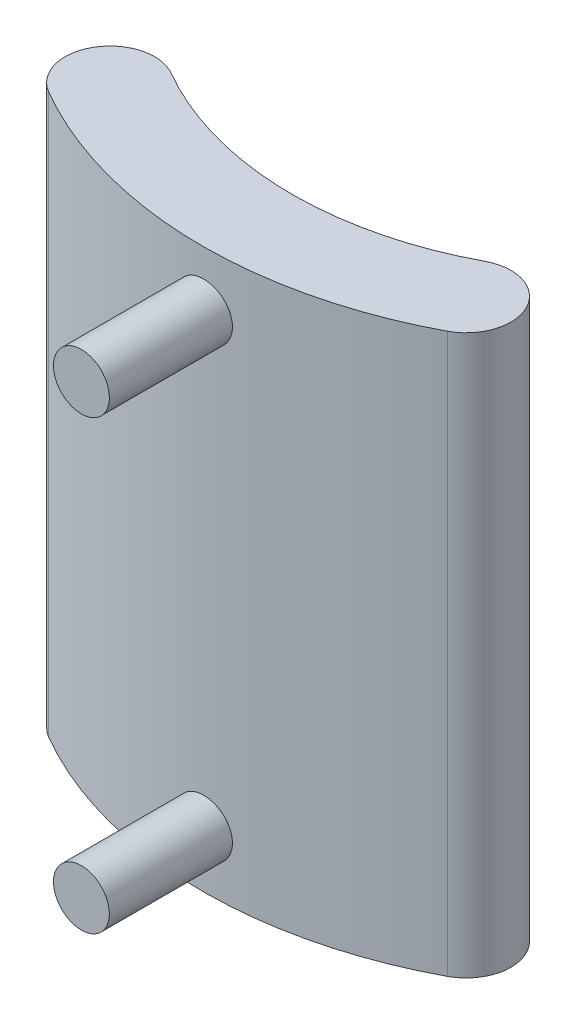
ISO-10303-21;
HEADER;
FILE_DESCRIPTION(('STEP AP214'),'2;1');
FILE_NAME('part.step','',(''),(''),'','','');
FILE_SCHEMA(('AUTOMOTIVE_DESIGN { 1 0 10303 214 1 1 1 1 }'));
ENDSEC;
DATA;
#1=APPLICATION_CONTEXT('core data for automotive mechanical design processes');
#2=APPLICATION_PROTOCOL_DEFINITION('international standard','automotive_design',2000,#1);
#3=PRODUCT_CONTEXT('',#1,'mechanical');
#4=PRODUCT('Part','Part','',(#3));
#5=PRODUCT_RELATED_PRODUCT_CATEGORY('part','',(#4));
#6=PRODUCT_DEFINITION_FORMATION('','',#4);
#7=PRODUCT_DEFINITION_CONTEXT('part definition',#1,'design');
#8=PRODUCT_DEFINITION('design','',#6,#7);
#9=PRODUCT_DEFINITION_SHAPE('','',#8);
#10=(LENGTH_UNIT() NAMED_UNIT(*) SI_UNIT(.MILLI.,.METRE.));
#11=(NAMED_UNIT(*) PLANE_ANGLE_UNIT() SI_UNIT($,.RADIAN.));
#12=(NAMED_UNIT(*) SI_UNIT($,.STERADIAN.) SOLID_ANGLE_UNIT());
#13=UNCERTAINTY_MEASURE_WITH_UNIT(LENGTH_MEASURE(1.E-05),#10,'distance_accuracy_value','');
#14=(GEOMETRIC_REPRESENTATION_CONTEXT(3) GLOBAL_UNCERTAINTY_ASSIGNED_CONTEXT((#13)) GLOBAL_UNIT_ASSIGNED_CONTEXT((#10,
#11,#12)) REPRESENTATION_CONTEXT('',''));
#15=CARTESIAN_POINT('',(0.,0.,0.));
#16=DIRECTION('',(0.,0.,1.));
#17=DIRECTION('',(1.,0.,0.));
#18=AXIS2_PLACEMENT_3D('',#15,#16,#17);
#19=CARTESIAN_POINT('',(-0.191971072793173,-100.,-56.8451117001666));
#20=DIRECTION('',(0.,1.,0.));
#21=DIRECTION('',(-1.,0.,0.));
#22=AXIS2_PLACEMENT_3D('',#19,#20,#21);
#23=CYLINDRICAL_SURFACE('',#22,75.);
#24=CARTESIAN_POINT('',(-0.191971072793173,0.,-56.8451117001666));
#25=DIRECTION('',(0.,-1.,0.));
#26=DIRECTION('',(1.,0.,0.));
#27=AXIS2_PLACEMENT_3D('',#24,#25,#26);
#28=CIRCLE('',#27,75.);
#29=CARTESIAN_POINT('',(34.9405614771913,0.,9.41728454856772));
#30=VERTEX_POINT('',#29);
#31=CARTESIAN_POINT('',(-37.8260161754019,0.,8.02921796276562));
#32=VERTEX_POINT('',#31);
#33=EDGE_CURVE('E11',#30,#32,#28,.T.);
#34=ORIENTED_EDGE('',*,*,#33,.T.);
#35=DIRECTION('',(0.,1.,0.));
#36=VECTOR('',#35,1.);
#37=CARTESIAN_POINT('',(-37.8260161754019,-100.,8.02921796276562));
#38=LINE('',#37,#36);
#39=CARTESIAN_POINT('',(-37.8260161754019,-100.,8.02921796276562));
#40=VERTEX_POINT('',#39);
#41=EDGE_CURVE('E26',#40,#32,#38,.T.);
#42=ORIENTED_EDGE('',*,*,#41,.F.);
#43=CARTESIAN_POINT('',(-0.191971072793173,-100.,-56.8451117001666));
#44=DIRECTION('',(0.,-1.,0.));
#45=DIRECTION('',(1.,0.,0.));
#46=AXIS2_PLACEMENT_3D('',#43,#44,#45);
#47=CIRCLE('',#46,75.);
#48=CARTESIAN_POINT('',(34.9405614771913,-100.,9.41728454856772));
#49=VERTEX_POINT('',#48);
#50=EDGE_CURVE('E139',#49,#40,#47,.T.);
#51=ORIENTED_EDGE('',*,*,#50,.F.);
#52=DIRECTION('',(0.,1.,0.));
#53=VECTOR('',#52,1.);
#54=CARTESIAN_POINT('',(34.9405614771913,-100.,9.41728454856772));
#55=LINE('',#54,#53);
#56=EDGE_CURVE('E155',#49,#30,#55,.T.);
#57=ORIENTED_EDGE('',*,*,#56,.T.);
#58=EDGE_LOOP('',(#34,#42,#51,#57));
#59=FACE_BOUND('',#58,.T.);
#60=CARTESIAN_POINT('',(0.,-5.,18.154642613479));
#61=CARTESIAN_POINT('',(-0.140294453144583,-4.99999882962762,18.1550019292578));
#62=CARTESIAN_POINT('',(-0.280571345387169,-5.00590709666798,18.1549663018076));
#63=CARTESIAN_POINT('',(-0.560174688351108,-5.02949827508874,18.1541147302588));
#64=CARTESIAN_POINT('',(-0.699500890229425,-5.04718415818762,18.153298589199));
#65=CARTESIAN_POINT('',(-0.976281090750882,-5.09422797285176,18.1509150735892));
#66=CARTESIAN_POINT('',(-1.11373340021224,-5.12359579712388,18.1493470620954));
#67=CARTESIAN_POINT('',(-1.38572018207489,-5.1938047692477,18.1455108335591));
#68=CARTESIAN_POINT('',(-1.52025356837616,-5.2346501114879,18.1432423605074));
#69=CARTESIAN_POINT('',(-1.78527406655918,-5.32747475318481,18.138079334349));
#70=CARTESIAN_POINT('',(-1.91576470660259,-5.37944401229143,18.1351853458044));
#71=CARTESIAN_POINT('',(-2.17194961978498,-5.49418805799727,18.1288578541725));
#72=CARTESIAN_POINT('',(-2.29764210642546,-5.5569668222762,18.1254241525224));
#73=CARTESIAN_POINT('',(-2.54321730611112,-5.69282859983151,18.1181241214448));
#74=CARTESIAN_POINT('',(-2.66310344386201,-5.76590543713623,18.1142580516024));
#75=CARTESIAN_POINT('',(-2.8963438683719,-5.92190197695775,18.1062057797444));
#76=CARTESIAN_POINT('',(-3.00969572397826,-6.00482530830733,18.1020194599071));
#77=CARTESIAN_POINT('',(-3.2291362330847,-6.1799986966506,18.0934478020605));
#78=CARTESIAN_POINT('',(-3.33521708878078,-6.27225851197646,18.0890622585191));
#79=CARTESIAN_POINT('',(-3.53927241534961,-6.4654144463437,18.0802245331646));
#80=CARTESIAN_POINT('',(-3.63724387728428,-6.56631374300866,18.0757723273339));
#81=CARTESIAN_POINT('',(-3.82431308017225,-6.77597135074951,18.0669357949656));
#82=CARTESIAN_POINT('',(-3.91341370734125,-6.88472708565003,18.0625514467445));
#83=CARTESIAN_POINT('',(-4.08217789520284,-7.10939954503547,18.0539766447989));
#84=CARTESIAN_POINT('',(-4.16183796005892,-7.22531889818051,18.049786263248));
#85=CARTESIAN_POINT('',(-4.31116305103235,-7.46353679271612,18.0417219550528));
#86=CARTESIAN_POINT('',(-4.38082189577474,-7.58583921611882,18.0378482247501));
#87=CARTESIAN_POINT('',(-4.50961307946275,-7.83593340242094,18.0305327345389));
#88=CARTESIAN_POINT('',(-4.56874151708729,-7.9637271780902,18.0270911348655));
#89=CARTESIAN_POINT('',(-4.67599685438863,-8.22381791017666,18.0207443888099));
#90=CARTESIAN_POINT('',(-4.72412790636621,-8.35611314522171,18.0178390400343));
#91=CARTESIAN_POINT('',(-4.80908572191675,-8.62431106615704,18.01264698661));
#92=CARTESIAN_POINT('',(-4.84590831269954,-8.76021506362145,18.0103605103603));
#93=CARTESIAN_POINT('',(-4.93884325351366,-9.17142943420016,18.0045461550114));
#94=CARTESIAN_POINT('',(-4.97768491254517,-9.45087963849477,18.0020472829006));
#95=CARTESIAN_POINT('',(-5.00789008116931,-10.0121920216525,18.0001093726219));
#96=CARTESIAN_POINT('',(-4.99925415609975,-10.2940541717555,18.0006702980197));
#97=CARTESIAN_POINT('',(-4.93486482471639,-10.8519302951147,18.0047779907509));
#98=CARTESIAN_POINT('',(-4.87918199103181,-11.1279523933899,18.0083202858556));
#99=CARTESIAN_POINT('',(-4.72237223633449,-11.6667133145613,18.0179738648899));
#100=CARTESIAN_POINT('',(-4.62124502046177,-11.929452051258,18.0240851654882));
#101=CARTESIAN_POINT('',(-4.37634061211336,-12.4344284261695,18.0381710322667));
#102=CARTESIAN_POINT('',(-4.23253134778357,-12.676650471315,18.0461469986211));
#103=CARTESIAN_POINT('',(-3.90636608676368,-13.1335430323484,18.0630310302189));
#104=CARTESIAN_POINT('',(-3.72400962973405,-13.3482132191562,18.0719391065932));
#105=CARTESIAN_POINT('',(-3.32553432056674,-13.7443131530986,18.0896634825052));
#106=CARTESIAN_POINT('',(-3.10935532459279,-13.9256824105815,18.0984795881233));
#107=CARTESIAN_POINT('',(-2.64958178847363,-14.2495633550054,18.1149641752844));
#108=CARTESIAN_POINT('',(-2.40598725941719,-14.3920750576632,18.1226326572916));
#109=CARTESIAN_POINT('',(-1.89828929332798,-14.6341757342133,18.1359051181318));
#110=CARTESIAN_POINT('',(-1.63418693878571,-14.7337669718158,18.1415092058427));
#111=CARTESIAN_POINT('',(-1.09296623303252,-14.8871807765873,18.1499641507862));
#112=CARTESIAN_POINT('',(-0.815848053599872,-14.941003947608,18.1528150443438));
#113=CARTESIAN_POINT('',(-0.257021841556543,-15.0012770012358,18.1553794766487));
#114=CARTESIAN_POINT('',(0.0246765632230636,-15.0078159183621,18.155098914349));
#115=CARTESIAN_POINT('',(0.58515957391871,-14.9735717549948,18.1513856649436));
#116=CARTESIAN_POINT('',(0.863944194548433,-14.9327889135778,18.147952993763));
#117=CARTESIAN_POINT('',(1.41047515473162,-14.8051275301889,18.1382654697442));
#118=CARTESIAN_POINT('',(1.67822965610574,-14.718283756477,18.1320127461036));
#119=CARTESIAN_POINT('',(2.19536136804439,-14.5010054014609,18.1173297170387));
#120=CARTESIAN_POINT('',(2.44473837514299,-14.3705703376254,18.1088993875096));
#121=CARTESIAN_POINT('',(2.91848465439897,-14.0695623004696,18.0907370855915));
#122=CARTESIAN_POINT('',(3.14281223377653,-13.8989238373883,18.08100300072));
#123=CARTESIAN_POINT('',(3.55966879430807,-13.5224471995671,18.0612887839201));
#124=CARTESIAN_POINT('',(3.75219741862638,-13.316608629878,18.051308649232));
#125=CARTESIAN_POINT('',(4.10029559127836,-12.8751886645891,18.0321676987158));
#126=CARTESIAN_POINT('',(4.2558068449366,-12.6395612394201,18.0230081891618));
#127=CARTESIAN_POINT('',(4.52505270776391,-12.1454680725126,18.0065279946079));
#128=CARTESIAN_POINT('',(4.6387876387427,-11.887002506719,17.9992072954435));
#129=CARTESIAN_POINT('',(4.82113955189221,-11.3548761963516,17.9872148987155));
#130=CARTESIAN_POINT('',(4.88979997951813,-11.0812303602009,17.9825406509461));
#131=CARTESIAN_POINT('',(4.98017790688699,-10.5261079753339,17.9763492909275));
#132=CARTESIAN_POINT('',(5.0018959934601,-10.2446315245533,17.9748321392112));
#133=CARTESIAN_POINT('',(4.99885448096462,-9.8232536349677,17.9750407166736));
#134=CARTESIAN_POINT('',(4.99191676523501,-9.68300488814512,17.9755234177597));
#135=CARTESIAN_POINT('',(4.96628183196596,-9.40360542252909,17.9772955354854));
#136=CARTESIAN_POINT('',(4.94758896652127,-9.26445431665439,17.9785846535653));
#137=CARTESIAN_POINT('',(4.89856402729925,-8.98818446340598,17.981935858526));
#138=CARTESIAN_POINT('',(4.8682276606452,-8.85106648502126,17.9839982304936));
#139=CARTESIAN_POINT('',(4.79615023133589,-8.57992593106946,17.9888374867273));
#140=CARTESIAN_POINT('',(4.75441336107173,-8.44590223722881,17.9916141083153));
#141=CARTESIAN_POINT('',(4.6598120201772,-8.18180470400367,17.9978067757849));
#142=CARTESIAN_POINT('',(4.60694367724903,-8.05173225720167,18.0012230441341));
#143=CARTESIAN_POINT('',(4.49048755419757,-7.79655183345001,18.0085988423973));
#144=CARTESIAN_POINT('',(4.42690371486294,-7.6714420522247,18.0125581724928));
#145=CARTESIAN_POINT('',(4.28943180219202,-7.4269770643788,18.0209137682598));
#146=CARTESIAN_POINT('',(4.21554021909394,-7.30762383655775,18.0253101826103));
#147=CARTESIAN_POINT('',(4.05802228786359,-7.07560098136109,18.0344167115245));
#148=CARTESIAN_POINT('',(3.97439951194605,-6.96292892418519,18.0391267107047));
#149=CARTESIAN_POINT('',(3.7977815598556,-6.74475818672754,18.048744596072));
#150=CARTESIAN_POINT('',(3.70476492179814,-6.63927689910843,18.0536529192965));
#151=CARTESIAN_POINT('',(3.510217143988,-6.43656006172413,18.0635211974304));
#152=CARTESIAN_POINT('',(3.40868914114345,-6.33932150040125,18.0684811327326));
#153=CARTESIAN_POINT('',(3.19774131289175,-6.15367665709832,18.0783225694654));
#154=CARTESIAN_POINT('',(3.08831668011266,-6.06527583487531,18.083204020867));
#155=CARTESIAN_POINT('',(2.86244607433512,-5.8980318951128,18.0927512644326));
#156=CARTESIAN_POINT('',(2.74600270543615,-5.81918526505501,18.09741713546));
#157=CARTESIAN_POINT('',(2.50665707680112,-5.67143371870758,18.1064177812246));
#158=CARTESIAN_POINT('',(2.38374316636091,-5.6025476347627,18.110751921666));
#159=CARTESIAN_POINT('',(2.13257626499792,-5.4754089448066,18.1189614325268));
#160=CARTESIAN_POINT('',(2.00432524572724,-5.41715245405793,18.1228369703663));
#161=CARTESIAN_POINT('',(1.74346254077241,-5.31170485877948,18.1300248579877));
#162=CARTESIAN_POINT('',(1.61085470163469,-5.26450427746875,18.1333376894294));
#163=CARTESIAN_POINT('',(1.3421634649431,-5.18145554539349,18.1393166362665));
#164=CARTESIAN_POINT('',(1.20608096351348,-5.14560449888296,18.1419829165837));
#165=CARTESIAN_POINT('',(0.893384665576057,-5.0771900490972,18.1472393042843));
#166=CARTESIAN_POINT('',(0.715957982442994,-5.04827004653641,18.1496049445058));
#167=CARTESIAN_POINT('',(0.359011282609291,-5.00967578547629,18.1530767456927));
#168=CARTESIAN_POINT('',(0.179491269130226,-5.0000014973623,18.1541829085961));
#169=CARTESIAN_POINT('',(0.,-5.,18.154642613479));
#170=B_SPLINE_CURVE_WITH_KNOTS('',3,(#60,#61,#62,#63,#64,#65,#66,#67,#68,#69,#70,#71,#72,#73,
#74,#75,#76,#77,#78,#79,#80,#81,#82,#83,#84,#85,#86,#87,#88,#89,#90,#91,#92,#93,#94,#95,#96,#97,
#98,#99,#100,#101,#102,#103,#104,#105,#106,#107,#108,#109,#110,#111,#112,#113,#114,#115,#116,
#117,#118,#119,#120,#121,#122,#123,#124,#125,#126,#127,#128,#129,#130,#131,#132,#133,#134,#135,
#136,#137,#138,#139,#140,#141,#142,#143,#144,#145,#146,#147,#148,#149,#150,#151,#152,#153,#154,
#155,#156,#157,#158,#159,#160,#161,#162,#163,#164,#165,#166,#167,#168,#169),.UNSPECIFIED.,.T.,
.F.,(4,2,2,2,2,2,2,2,2,2,2,2,2,2,2,2,2,2,2,2,2,2,2,2,2,2,2,2,2,2,2,2,2,2,2,2,2,2,2,2,2,2,2,2,2,
2,2,2,2,2,2,2,2,2,4),(0.,0.420727921781488,0.841562041532132,1.26275330072775,1.68409868230995,
2.10506535291867,2.52618726312102,2.94705768401496,3.36808369698521,3.78955439534763,
4.21118078313831,4.6326695391178,5.05431388773952,5.47621772713377,5.89827755040234,
6.32017775154831,6.74223344613729,7.58430268850883,8.4263619039893,9.26716022805092,
10.1079640076021,10.949401184672,11.790848410948,12.6338092855479,13.4767698191962,
14.3196858879985,15.1625908354151,16.003908209388,16.845221332921,17.6859003083895,
18.5265885900148,19.3686559054408,20.2107326695805,21.0541268842582,21.8975146019984,
22.7400882148959,23.5826512946484,24.0035051568368,24.4242032984708,24.8450566977702,
25.2657555414234,25.6866009758086,26.1072919742201,26.528126568136,26.9488071627076,
27.3704716043128,27.7919813167979,28.2137498399654,28.635362829986,29.0577628203096,
29.480008127931,29.9018901645996,30.3236644744157,30.8619402447666,31.4002151868362),.UNSPECIFIED.);
#171=CARTESIAN_POINT('',(0.,-5.,18.154642613479));
#172=VERTEX_POINT('',#171);
#173=EDGE_CURVE('E99',#172,#172,#170,.T.);
#174=ORIENTED_EDGE('',*,*,#173,.F.);
#175=EDGE_LOOP('',(#174));
#176=FACE_BOUND('',#175,.T.);
#177=CARTESIAN_POINT('',(0.,-85.,18.154642613479));
#178=CARTESIAN_POINT('',(-0.140294453144585,-84.9999988296276,18.1550019292578));
#179=CARTESIAN_POINT('',(-0.280571345387172,-85.005907096668,18.1549663018076));
#180=CARTESIAN_POINT('',(-0.560174688351112,-85.0294982750887,18.1541147302588));
#181=CARTESIAN_POINT('',(-0.699500890229428,-85.0471841581876,18.153298589199));
#182=CARTESIAN_POINT('',(-0.976281090750886,-85.0942279728518,18.1509150735892));
#183=CARTESIAN_POINT('',(-1.11373340021224,-85.1235957971239,18.1493470620953));
#184=CARTESIAN_POINT('',(-1.3857201820749,-85.1938047692477,18.1455108335591));
#185=CARTESIAN_POINT('',(-1.52025356837616,-85.2346501114879,18.1432423605074));
#186=CARTESIAN_POINT('',(-1.78527406655917,-85.3274747531848,18.138079334349));
#187=CARTESIAN_POINT('',(-1.91576470660259,-85.3794440122914,18.1351853458044));
#188=CARTESIAN_POINT('',(-2.17194961978498,-85.4941880579973,18.1288578541725));
#189=CARTESIAN_POINT('',(-2.29764210642546,-85.5569668222762,18.1254241525224));
#190=CARTESIAN_POINT('',(-2.54321730611111,-85.6928285998315,18.1181241214448));
#191=CARTESIAN_POINT('',(-2.66310344386201,-85.7659054371362,18.1142580516024));
#192=CARTESIAN_POINT('',(-2.8963438683719,-85.9219019769577,18.1062057797444));
#193=CARTESIAN_POINT('',(-3.00969572397826,-86.0048253083073,18.1020194599071));
#194=CARTESIAN_POINT('',(-3.2291362330847,-86.1799986966506,18.0934478020604));
#195=CARTESIAN_POINT('',(-3.33521708878078,-86.2722585119765,18.0890622585191));
#196=CARTESIAN_POINT('',(-3.53927241534961,-86.4654144463437,18.0802245331646));
#197=CARTESIAN_POINT('',(-3.63724387728428,-86.5663137430086,18.0757723273339));
#198=CARTESIAN_POINT('',(-3.82431308017225,-86.7759713507495,18.0669357949656));
#199=CARTESIAN_POINT('',(-3.91341370734124,-86.88472708565,18.0625514467445));
#200=CARTESIAN_POINT('',(-4.08217789520284,-87.1093995450355,18.0539766447989));
#201=CARTESIAN_POINT('',(-4.16183796005892,-87.2253188981805,18.049786263248));
#202=CARTESIAN_POINT('',(-4.31116305103235,-87.4635367927161,18.0417219550528));
#203=CARTESIAN_POINT('',(-4.38082189577474,-87.5858392161188,18.0378482247501));
#204=CARTESIAN_POINT('',(-4.50961307946275,-87.8359334024209,18.0305327345389));
#205=CARTESIAN_POINT('',(-4.56874151708728,-87.9637271780902,18.0270911348655));
#206=CARTESIAN_POINT('',(-4.67599685438863,-88.2238179101766,18.0207443888099));
#207=CARTESIAN_POINT('',(-4.7241279063662,-88.3561131452217,18.0178390400343));
#208=CARTESIAN_POINT('',(-4.80908572191675,-88.624311066157,18.01264698661));
#209=CARTESIAN_POINT('',(-4.84590831269954,-88.7602150636214,18.0103605103603));
#210=CARTESIAN_POINT('',(-4.93884325351365,-89.1714294342002,18.0045461550114));
#211=CARTESIAN_POINT('',(-4.97768491254517,-89.4508796384948,18.0020472829006));
#212=CARTESIAN_POINT('',(-5.00789008116931,-90.0121920216525,18.0001093726219));
#213=CARTESIAN_POINT('',(-4.99925415609976,-90.2940541717555,18.0006702980197));
#214=CARTESIAN_POINT('',(-4.93486482471639,-90.8519302951148,18.0047779907509));
#215=CARTESIAN_POINT('',(-4.87918199103181,-91.1279523933899,18.0083202858556));
#216=CARTESIAN_POINT('',(-4.72237223633448,-91.6667133145613,18.0179738648899));
#217=CARTESIAN_POINT('',(-4.62124502046177,-91.929452051258,18.0240851654882));
#218=CARTESIAN_POINT('',(-4.37634061211337,-92.4344284261695,18.0381710322667));
#219=CARTESIAN_POINT('',(-4.23253134778358,-92.676650471315,18.0461469986211));
#220=CARTESIAN_POINT('',(-3.90636608676369,-93.1335430323483,18.0630310302189));
#221=CARTESIAN_POINT('',(-3.72400962973405,-93.3482132191562,18.0719391065932));
#222=CARTESIAN_POINT('',(-3.32553432056674,-93.7443131530987,18.0896634825052));
#223=CARTESIAN_POINT('',(-3.10935532459279,-93.9256824105815,18.0984795881233));
#224=CARTESIAN_POINT('',(-2.64958178847362,-94.2495633550054,18.1149641752844));
#225=CARTESIAN_POINT('',(-2.40598725941718,-94.3920750576632,18.1226326572916));
#226=CARTESIAN_POINT('',(-1.89828929332797,-94.6341757342133,18.1359051181318));
#227=CARTESIAN_POINT('',(-1.6341869387857,-94.7337669718159,18.1415092058427));
#228=CARTESIAN_POINT('',(-1.09296623303251,-94.8871807765873,18.1499641507862));
#229=CARTESIAN_POINT('',(-0.815848053599869,-94.941003947608,18.1528150443438));
#230=CARTESIAN_POINT('',(-0.257021841556543,-95.0012770012358,18.1553794766487));
#231=CARTESIAN_POINT('',(0.0246765632230651,-95.0078159183621,18.155098914349));
#232=CARTESIAN_POINT('',(0.585159573918712,-94.9735717549949,18.1513856649436));
#233=CARTESIAN_POINT('',(0.863944194548434,-94.9327889135778,18.147952993763));
#234=CARTESIAN_POINT('',(1.41047515473162,-94.8051275301889,18.1382654697442));
#235=CARTESIAN_POINT('',(1.67822965610573,-94.7182837564769,18.1320127461036));
#236=CARTESIAN_POINT('',(2.19536136804438,-94.5010054014609,18.1173297170386));
#237=CARTESIAN_POINT('',(2.44473837514298,-94.3705703376254,18.1088993875096));
#238=CARTESIAN_POINT('',(2.91848465439897,-94.0695623004696,18.0907370855915));
#239=CARTESIAN_POINT('',(3.14281223377654,-93.8989238373883,18.0810030007201));
#240=CARTESIAN_POINT('',(3.55966879430807,-93.5224471995671,18.0612887839201));
#241=CARTESIAN_POINT('',(3.75219741862639,-93.316608629878,18.051308649232));
#242=CARTESIAN_POINT('',(4.10029559127837,-92.8751886645891,18.0321676987158));
#243=CARTESIAN_POINT('',(4.25580684493661,-92.6395612394201,18.0230081891618));
#244=CARTESIAN_POINT('',(4.52505270776391,-92.1454680725126,18.0065279946079));
#245=CARTESIAN_POINT('',(4.6387876387427,-91.8870025067189,17.9992072954435));
#246=CARTESIAN_POINT('',(4.82113955189221,-91.3548761963516,17.9872148987155));
#247=CARTESIAN_POINT('',(4.88979997951813,-91.0812303602009,17.9825406509461));
#248=CARTESIAN_POINT('',(4.98017790688699,-90.5261079753339,17.9763492909275));
#249=CARTESIAN_POINT('',(5.0018959934601,-90.2446315245534,17.9748321392112));
#250=CARTESIAN_POINT('',(4.99885448096462,-89.8232536349677,17.9750407166736));
#251=CARTESIAN_POINT('',(4.99191676523501,-89.6830048881451,17.9755234177597));
#252=CARTESIAN_POINT('',(4.96628183196596,-89.4036054225291,17.9772955354854));
#253=CARTESIAN_POINT('',(4.94758896652127,-89.2644543166544,17.9785846535653));
#254=CARTESIAN_POINT('',(4.89856402729926,-88.988184463406,17.981935858526));
#255=CARTESIAN_POINT('',(4.86822766064521,-88.8510664850213,17.9839982304936));
#256=CARTESIAN_POINT('',(4.7961502313359,-88.5799259310695,17.9888374867273));
#257=CARTESIAN_POINT('',(4.75441336107173,-88.4459022372288,17.9916141083153));
#258=CARTESIAN_POINT('',(4.6598120201772,-88.1818047040037,17.9978067757849));
#259=CARTESIAN_POINT('',(4.60694367724904,-88.0517322572017,18.001223044134));
#260=CARTESIAN_POINT('',(4.49048755419758,-87.79655183345,18.0085988423973));
#261=CARTESIAN_POINT('',(4.42690371486295,-87.6714420522247,18.0125581724928));
#262=CARTESIAN_POINT('',(4.28943180219203,-87.4269770643788,18.0209137682598));
#263=CARTESIAN_POINT('',(4.21554021909396,-87.3076238365578,18.0253101826103));
#264=CARTESIAN_POINT('',(4.05802228786361,-87.0756009813611,18.0344167115245));
#265=CARTESIAN_POINT('',(3.97439951194606,-86.9629289241852,18.0391267107047));
#266=CARTESIAN_POINT('',(3.79778155985561,-86.7447581867276,18.048744596072));
#267=CARTESIAN_POINT('',(3.70476492179815,-86.6392768991084,18.0536529192966));
#268=CARTESIAN_POINT('',(3.51021714398801,-86.4365600617241,18.0635211974304));
#269=CARTESIAN_POINT('',(3.40868914114345,-86.3393215004012,18.0684811327325));
#270=CARTESIAN_POINT('',(3.19774131289174,-86.1536766570983,18.0783225694654));
#271=CARTESIAN_POINT('',(3.08831668011265,-86.0652758348753,18.0832040208671));
#272=CARTESIAN_POINT('',(2.86244607433511,-85.8980318951128,18.0927512644326));
#273=CARTESIAN_POINT('',(2.74600270543615,-85.819185265055,18.09741713546));
#274=CARTESIAN_POINT('',(2.50665707680112,-85.6714337187075,18.1064177812246));
#275=CARTESIAN_POINT('',(2.3837431663609,-85.6025476347627,18.110751921666));
#276=CARTESIAN_POINT('',(2.1325762649979,-85.4754089448066,18.1189614325268));
#277=CARTESIAN_POINT('',(2.00432524572723,-85.4171524540579,18.1228369703663));
#278=CARTESIAN_POINT('',(1.7434625407724,-85.3117048587795,18.1300248579877));
#279=CARTESIAN_POINT('',(1.61085470163468,-85.2645042774687,18.1333376894294));
#280=CARTESIAN_POINT('',(1.34216346494309,-85.1814555453935,18.1393166362665));
#281=CARTESIAN_POINT('',(1.20608096351348,-85.1456044988829,18.1419829165837));
#282=CARTESIAN_POINT('',(0.893384665576059,-85.0771900490972,18.1472393042843));
#283=CARTESIAN_POINT('',(0.715957982442993,-85.0482700465364,18.1496049445058));
#284=CARTESIAN_POINT('',(0.359011282609288,-85.0096757854763,18.1530767456927));
#285=CARTESIAN_POINT('',(0.179491269130224,-85.0000014973623,18.1541829085961));
#286=CARTESIAN_POINT('',(0.,-85.,18.154642613479));
#287=B_SPLINE_CURVE_WITH_KNOTS('',3,(#177,#178,#179,#180,#181,#182,#183,#184,#185,#186,#187,
#188,#189,#190,#191,#192,#193,#194,#195,#196,#197,#198,#199,#200,#201,#202,#203,#204,#205,#206,
#207,#208,#209,#210,#211,#212,#213,#214,#215,#216,#217,#218,#219,#220,#221,#222,#223,#224,#225,
#226,#227,#228,#229,#230,#231,#232,#233,#234,#235,#236,#237,#238,#239,#240,#241,#242,#243,#244,
#245,#246,#247,#248,#249,#250,#251,#252,#253,#254,#255,#256,#257,#258,#259,#260,#261,#262,#263,
#264,#265,#266,#267,#268,#269,#270,#271,#272,#273,#274,#275,#276,#277,#278,#279,#280,#281,#282,
#283,#284,#285,#286),.UNSPECIFIED.,.T.,.F.,(4,2,2,2,2,2,2,2,2,2,2,2,2,2,2,2,2,2,2,2,2,2,2,2,2,2,
2,2,2,2,2,2,2,2,2,2,2,2,2,2,2,2,2,2,2,2,2,2,2,2,2,2,2,2,4),(0.,0.42072792178149,
0.841562041532133,1.26275330072775,1.68409868230995,2.10506535291866,2.52618726312101,
2.94705768401495,3.36808369698522,3.78955439534762,4.2111807831383,4.63266953911779,
5.05431388773949,5.47621772713376,5.89827755040233,6.32017775154829,6.74223344613729,
7.58430268850882,8.42636190398929,9.26716022805092,10.1079640076021,10.949401184672,
11.790848410948,12.6338092855479,13.4767698191962,14.3196858879985,15.1625908354151,
16.003908209388,16.845221332921,17.6859003083895,18.5265885900148,19.3686559054408,
20.2107326695805,21.0541268842582,21.8975146019984,22.7400882148959,23.5826512946484,
24.0035051568368,24.4242032984708,24.8450566977702,25.2657555414234,25.6866009758086,
26.1072919742201,26.5281265681359,26.9488071627076,27.3704716043128,27.7919813167979,
28.2137498399654,28.6353628299861,29.0577628203096,29.480008127931,29.9018901645996,
30.3236644744157,30.8619402447666,31.4002151868362),.UNSPECIFIED.);
#288=CARTESIAN_POINT('',(0.,-85.,18.154642613479));
#289=VERTEX_POINT('',#288);
#290=EDGE_CURVE('E92',#289,#289,#287,.T.);
#291=ORIENTED_EDGE('',*,*,#290,.F.);
#292=EDGE_LOOP('',(#291));
#293=FACE_BOUND('',#292,.T.);
#294=ADVANCED_FACE('F17',(#59,#176,#293),#23,.T.);
#295=CARTESIAN_POINT('',(-0.191971072793173,-100.,-56.8451117001666));
#296=DIRECTION('',(0.,1.,0.));
#297=DIRECTION('',(-1.,0.,0.));
#298=AXIS2_PLACEMENT_3D('',#295,#296,#297);
#299=CYLINDRICAL_SURFACE('',#298,58.9657146111625);
#300=CARTESIAN_POINT('',(-0.191971072793173,0.,-56.8451117001666));
#301=DIRECTION('',(0.,1.,0.));
#302=DIRECTION('',(1.,0.,0.));
#303=AXIS2_PLACEMENT_3D('',#300,#301,#302);
#304=CIRCLE('',#303,58.9657146111625);
#305=CARTESIAN_POINT('',(-29.7802159152471,0.,-5.84029558690084));
#306=VERTEX_POINT('',#305);
#307=CARTESIAN_POINT('',(27.4295607660036,0.,-4.74898441143821));
#308=VERTEX_POINT('',#307);
#309=EDGE_CURVE('E70',#306,#308,#304,.T.);
#310=ORIENTED_EDGE('',*,*,#309,.T.);
#311=DIRECTION('',(0.,1.,0.));
#312=VECTOR('',#311,1.);
#313=CARTESIAN_POINT('',(27.4295607660036,-100.,-4.74898441143821));
#314=LINE('',#313,#312);
#315=CARTESIAN_POINT('',(27.4295607660036,-100.,-4.74898441143821));
#316=VERTEX_POINT('',#315);
#317=EDGE_CURVE('E93',#316,#308,#314,.T.);
#318=ORIENTED_EDGE('',*,*,#317,.F.);
#319=CARTESIAN_POINT('',(-0.191971072793173,-100.,-56.8451117001666));
#320=DIRECTION('',(0.,1.,0.));
#321=DIRECTION('',(1.,0.,0.));
#322=AXIS2_PLACEMENT_3D('',#319,#320,#321);
#323=CIRCLE('',#322,58.9657146111625);
#324=CARTESIAN_POINT('',(-29.7802159152471,-100.,-5.84029558690084));
#325=VERTEX_POINT('',#324);
#326=EDGE_CURVE('E73',#325,#316,#323,.T.);
#327=ORIENTED_EDGE('',*,*,#326,.F.);
#328=DIRECTION('',(0.,1.,0.));
#329=VECTOR('',#328,1.);
#330=CARTESIAN_POINT('',(-29.7802159152471,-100.,-5.84029558690084));
#331=LINE('',#330,#329);
#332=EDGE_CURVE('E65',#325,#306,#331,.T.);
#333=ORIENTED_EDGE('',*,*,#332,.T.);
#334=EDGE_LOOP('',(#310,#318,#327,#333));
#335=FACE_BOUND('',#334,.T.);
#336=CARTESIAN_POINT('',(0.,-45.,2.12029041592403));
#337=CARTESIAN_POINT('',(0.140230587924275,-44.9999987361941,2.11983416647504));
#338=CARTESIAN_POINT('',(0.280439838017571,-45.0059016739253,2.11887612975067));
#339=CARTESIAN_POINT('',(0.55990133463562,-45.0294695466457,2.11597468559151));
#340=CARTESIAN_POINT('',(0.699153336181716,-45.0471373870008,2.11403103478567));
#341=CARTESIAN_POINT('',(0.975775440908214,-45.0941297527913,2.10920132369803));
#342=CARTESIAN_POINT('',(1.11314389201997,-45.1234639089753,2.10631448515049));
#343=CARTESIAN_POINT('',(1.38495778582509,-45.1935877792117,2.09966994930148));
#344=CARTESIAN_POINT('',(1.51940213944455,-45.2343816852888,2.09591193340775));
#345=CARTESIAN_POINT('',(1.78423554661324,-45.3270814547824,2.08762660426115));
#346=CARTESIAN_POINT('',(1.91462832145973,-45.3789767541779,2.08310002320933));
#347=CARTESIAN_POINT('',(2.17061921845906,-45.49355083884,2.07339202487104));
#348=CARTESIAN_POINT('',(2.29621555459148,-45.5562335940359,2.06821036669434));
#349=CARTESIAN_POINT('',(2.5416067309248,-45.6918822922222,2.05733417025498));
#350=CARTESIAN_POINT('',(2.66140492352012,-45.764842195346,2.05163993393826));
#351=CARTESIAN_POINT('',(2.89448154304581,-45.9205847204029,2.03988582273106));
#352=CARTESIAN_POINT('',(3.0077575406553,-46.0033709676514,2.03382581330064));
#353=CARTESIAN_POINT('',(3.22717451852749,-46.1783413489081,2.02149211487898));
#354=CARTESIAN_POINT('',(3.33330027923306,-46.2705445397637,2.01521801041338));
#355=CARTESIAN_POINT('',(3.53745072065168,-46.4635913890942,2.00263573687322));
#356=CARTESIAN_POINT('',(3.63547239284204,-46.5644382283506,1.99632755606592));
#357=CARTESIAN_POINT('',(3.82264919696641,-46.7739987152951,1.98385328730478));
#358=CARTESIAN_POINT('',(3.91180719513877,-46.8827098001543,1.97768715391598));
#359=CARTESIAN_POINT('',(4.08069352216949,-47.1073041527126,1.96566119884083));
#360=CARTESIAN_POINT('',(4.16041835935217,-47.2231900521358,1.95980149102269));
#361=CARTESIAN_POINT('',(4.30991110825388,-47.4614060376214,1.94854598700507));
#362=CARTESIAN_POINT('',(4.37966859611367,-47.5837426895263,1.94315067878499));
#363=CARTESIAN_POINT('',(4.50865220937077,-47.833926761061,1.93297798723291));
#364=CARTESIAN_POINT('',(4.56787442767215,-47.9617762034095,1.9282008333271));
#365=CARTESIAN_POINT('',(4.67530826707591,-48.2219987399543,1.9194014473456));
#366=CARTESIAN_POINT('',(4.72352412254563,-48.3543700718804,1.91537892505456));
#367=CARTESIAN_POINT('',(4.80863900414838,-48.6227395642652,1.90819624580518));
#368=CARTESIAN_POINT('',(4.84553385929833,-48.7587390414271,1.90503640673139));
#369=CARTESIAN_POINT('',(4.93857717916723,-49.1698955947757,1.89701177063356));
#370=CARTESIAN_POINT('',(4.97749261808885,-49.4492025408082,1.89356731425221));
#371=CARTESIAN_POINT('',(5.00788719999966,-50.0102515464626,1.89088383521591));
#372=CARTESIAN_POINT('',(4.99936731978245,-50.2919935558221,1.89164472596395));
#373=CARTESIAN_POINT('',(4.93529411787965,-50.8492789736514,1.89727222888289));
#374=CARTESIAN_POINT('',(4.8798710436344,-51.1248373805598,1.90212747114607));
#375=CARTESIAN_POINT('',(4.72375100126054,-51.6627141650147,1.91539593730014));
#376=CARTESIAN_POINT('',(4.62305356413814,-51.925032405376,1.92380919804822));
#377=CARTESIAN_POINT('',(4.37910349754596,-52.4294099667271,1.94328593141716));
#378=CARTESIAN_POINT('',(4.23579262746677,-52.6714409766461,1.95435302705292));
#379=CARTESIAN_POINT('',(3.91072638227578,-53.1280614178838,1.9779266532933));
#380=CARTESIAN_POINT('',(3.72897014396864,-53.3426502328825,1.99043321621471));
#381=CARTESIAN_POINT('',(3.33143424262719,-53.7390650110976,2.01557825502586));
#382=CARTESIAN_POINT('',(3.11554037386681,-53.9207764451976,2.02821703573589));
#383=CARTESIAN_POINT('',(2.65625651249595,-54.2453952834998,2.0522217656298));
#384=CARTESIAN_POINT('',(2.41286646318654,-54.3883026076834,2.06358771218892));
#385=CARTESIAN_POINT('',(1.90537515042854,-54.6312755072945,2.08383765167794));
#386=CARTESIAN_POINT('',(1.64126762761325,-54.7313280755794,2.09272089078027));
#387=CARTESIAN_POINT('',(1.09990812205601,-54.8856337892508,2.10707070834705));
#388=CARTESIAN_POINT('',(0.822656423241792,-54.9398879234549,2.11253736057714));
#389=CARTESIAN_POINT('',(0.263810244295524,-55.0009164180935,2.11950133247666));
#390=CARTESIAN_POINT('',(-0.0177678435928688,-55.0078395029982,2.12101107638478));
#391=CARTESIAN_POINT('',(-0.578091184882361,-54.9743923124936,2.12000434343209));
#392=CARTESIAN_POINT('',(-0.856836469578513,-54.9340225601204,2.11748791109874));
#393=CARTESIAN_POINT('',(-1.40309147865187,-54.8072671845762,2.10879591189753));
#394=CARTESIAN_POINT('',(-1.67061963674917,-54.7209605281583,2.1026266223475));
#395=CARTESIAN_POINT('',(-2.18740244564157,-54.5048546451406,2.08739754675783));
#396=CARTESIAN_POINT('',(-2.43665682273732,-54.3750547672743,2.0783377174354));
#397=CARTESIAN_POINT('',(-2.91042718752172,-54.0753116732484,2.05838495952095));
#398=CARTESIAN_POINT('',(-3.13488689368516,-53.9052797736432,2.04748799681278));
#399=CARTESIAN_POINT('',(-3.55213275885617,-53.5300257457389,2.02515716681179));
#400=CARTESIAN_POINT('',(-3.74491835288028,-53.3248029898603,2.01372328994649));
#401=CARTESIAN_POINT('',(-4.09385005469854,-52.8843604318579,1.99162486827757));
#402=CARTESIAN_POINT('',(-4.24990002536623,-52.6490643542972,1.98096239159077));
#403=CARTESIAN_POINT('',(-4.52027415086784,-52.1555214674864,1.9616884857945));
#404=CARTESIAN_POINT('',(-4.63459867994927,-51.8972748641119,1.953077038289));
#405=CARTESIAN_POINT('',(-4.81814517663895,-51.3654898480779,1.93892115063855));
#406=CARTESIAN_POINT('',(-4.88741542895418,-51.0919681483751,1.93337342806286));
#407=CARTESIAN_POINT('',(-4.97901968221436,-50.5369757431029,1.92598558563683));
#408=CARTESIAN_POINT('',(-5.00135454985826,-50.2555051844127,1.92414539732397));
#409=CARTESIAN_POINT('',(-4.99922610611087,-49.834180204535,1.9243163691379));
#410=CARTESIAN_POINT('',(-4.99260100205876,-49.694016255362,1.924860024854));
#411=CARTESIAN_POINT('',(-4.96760588131901,-49.4147605030905,1.92689695659126));
#412=CARTESIAN_POINT('',(-4.94924021575621,-49.2756683221072,1.92838988080654));
#413=CARTESIAN_POINT('',(-4.90088272683047,-48.9994902281929,1.93228386408053));
#414=CARTESIAN_POINT('',(-4.87088662272414,-48.8624050732773,1.93468525750595));
#415=CARTESIAN_POINT('',(-4.79950104536226,-48.5913030435927,1.94032399186801));
#416=CARTESIAN_POINT('',(-4.75811575198809,-48.4572850626652,1.94356102609395));
#417=CARTESIAN_POINT('',(-4.66422955152202,-48.1931763147867,1.95077776935477));
#418=CARTESIAN_POINT('',(-4.6117252569479,-48.0630867584897,1.95475770467579));
#419=CARTESIAN_POINT('',(-4.49600575118757,-47.8078412045686,1.96334133139804));
#420=CARTESIAN_POINT('',(-4.43279446883761,-47.6826834179648,1.96794479387769));
#421=CARTESIAN_POINT('',(-4.2960732971205,-47.4380884128623,1.97764359342024));
#422=CARTESIAN_POINT('',(-4.22255984230377,-47.3186531941562,1.98273910058285));
#423=CARTESIAN_POINT('',(-4.06580010005402,-47.0864304107174,1.99326960379069));
#424=CARTESIAN_POINT('',(-3.9825573727237,-46.9736404369607,1.99870447531992));
#425=CARTESIAN_POINT('',(-3.8066239063354,-46.7551032933807,2.00977403671491));
#426=CARTESIAN_POINT('',(-3.71390394994508,-46.649379672815,2.01540930731092));
#427=CARTESIAN_POINT('',(-3.51992789570423,-46.4461524380976,2.02669509369451));
#428=CARTESIAN_POINT('',(-3.41867493823456,-46.3486458260534,2.03234560313908));
#429=CARTESIAN_POINT('',(-3.20825246088844,-46.1624401502756,2.04350053079692));
#430=CARTESIAN_POINT('',(-3.09907815131507,-46.0737464934471,2.04900485782596));
#431=CARTESIAN_POINT('',(-2.87367913219307,-45.9058937618217,2.05969849322904));
#432=CARTESIAN_POINT('',(-2.75745704165906,-45.8267311774522,2.06488791720676));
#433=CARTESIAN_POINT('',(-2.5184994971068,-45.6783125140775,2.07480930385633));
#434=CARTESIAN_POINT('',(-2.39575114393002,-45.6090771357318,2.07954030413307));
#435=CARTESIAN_POINT('',(-2.14487887270318,-45.4812270751765,2.0883880898262));
#436=CARTESIAN_POINT('',(-2.01675694330488,-45.4226085058764,2.09250509994252));
#437=CARTESIAN_POINT('',(-1.75611274260089,-45.3164274864644,2.09999783686188));
#438=CARTESIAN_POINT('',(-1.62359427067803,-45.2688557604431,2.10337418545724));
#439=CARTESIAN_POINT('',(-1.35504530430412,-45.1850609442638,2.10928424356418));
#440=CARTESIAN_POINT('',(-1.21901569920962,-45.1488350102088,2.11181816424563));
#441=CARTESIAN_POINT('',(-0.904296772912585,-45.079101822378,2.11656669222001));
#442=CARTESIAN_POINT('',(-0.724731556905785,-45.0494656993944,2.11847287383176));
#443=CARTESIAN_POINT('',(-0.363432282073049,-45.0099156347709,2.12063031692592));
#444=CARTESIAN_POINT('',(-0.181698229363377,-45.0000016375264,2.1208815830742));
#445=CARTESIAN_POINT('',(0.,-45.,2.12029041592403));
#446=B_SPLINE_CURVE_WITH_KNOTS('',3,(#336,#337,#338,#339,#340,#341,#342,#343,#344,#345,#346,
#347,#348,#349,#350,#351,#352,#353,#354,#355,#356,#357,#358,#359,#360,#361,#362,#363,#364,#365,
#366,#367,#368,#369,#370,#371,#372,#373,#374,#375,#376,#377,#378,#379,#380,#381,#382,#383,#384,
#385,#386,#387,#388,#389,#390,#391,#392,#393,#394,#395,#396,#397,#398,#399,#400,#401,#402,#403,
#404,#405,#406,#407,#408,#409,#410,#411,#412,#413,#414,#415,#416,#417,#418,#419,#420,#421,#422,
#423,#424,#425,#426,#427,#428,#429,#430,#431,#432,#433,#434,#435,#436,#437,#438,#439,#440,#441,
#442,#443,#444,#445),.UNSPECIFIED.,.T.,.F.,(4,2,2,2,2,2,2,2,2,2,2,2,2,2,2,2,2,2,2,2,2,2,2,2,2,2,
2,2,2,2,2,2,2,2,2,2,2,2,2,2,2,2,2,2,2,2,2,2,2,2,2,2,2,2,4),(0.,0.420535083159261,
0.841174056820869,1.26216099852758,1.68330214001114,2.10404429473333,2.52494162065567,
2.9455926098782,3.36639927861817,3.78807506323047,4.20990669232041,4.63160146734434,
5.05345184720096,5.47574021908806,5.89818487526164,6.32046673360686,6.74290398647922,
7.58460024023178,8.42627916174117,9.26562843047315,10.1049863941627,10.9454968391788,
11.786026157775,12.6294293560497,13.472834293509,14.3164950375362,15.1601375659191,
16.0011279622947,16.8421090578088,17.6816491316784,18.5212017773665,19.3626225785273,
20.2040583868095,21.0476723430926,21.8912787325731,22.7339795321262,23.5766647704066,
23.9972201323157,24.4176197240889,24.8381741968433,25.258574529662,25.679103125139,
26.0994777442627,26.5199982105939,26.9403652804152,27.3620697980848,27.7836197889536,
28.2054268317394,28.6270780767867,29.0495961648205,29.4719592438642,29.8939663765184,
30.3158676455119,30.8607608571758,31.4056525325675),.UNSPECIFIED.);
#447=CARTESIAN_POINT('',(0.,-45.,2.12029041592403));
#448=VERTEX_POINT('',#447);
#449=EDGE_CURVE('E77',#448,#448,#446,.T.);
#450=ORIENTED_EDGE('',*,*,#449,.F.);
#451=EDGE_LOOP('',(#450));
#452=FACE_BOUND('',#451,.T.);
#453=ADVANCED_FACE('F67',(#335,#452),#299,.F.);
#454=CARTESIAN_POINT('',(31.1850611215974,-100.,2.33415006856474));
#455=DIRECTION('',(0.,1.,0.));
#456=DIRECTION('',(-1.,0.,0.));
#457=AXIS2_PLACEMENT_3D('',#454,#455,#456);
#458=CYLINDRICAL_SURFACE('',#457,8.01714269441876);
#459=CARTESIAN_POINT('',(31.1850611215974,0.,2.33415006856474));
#460=DIRECTION('',(0.,-1.,0.));
#461=DIRECTION('',(1.,0.,0.));
#462=AXIS2_PLACEMENT_3D('',#459,#460,#461);
#463=CIRCLE('',#462,8.01714269441876);
#464=EDGE_CURVE('E90',#308,#30,#463,.T.);
#465=ORIENTED_EDGE('',*,*,#464,.T.);
#466=ORIENTED_EDGE('',*,*,#56,.F.);
#467=CARTESIAN_POINT('',(31.1850611215974,-100.,2.33415006856474));
#468=DIRECTION('',(0.,-1.,0.));
#469=DIRECTION('',(1.,0.,0.));
#470=AXIS2_PLACEMENT_3D('',#467,#468,#469);
#471=CIRCLE('',#470,8.01714269441876);
#472=EDGE_CURVE('E84',#316,#49,#471,.T.);
#473=ORIENTED_EDGE('',*,*,#472,.F.);
#474=ORIENTED_EDGE('',*,*,#317,.T.);
#475=EDGE_LOOP('',(#465,#466,#473,#474));
#476=FACE_BOUND('',#475,.T.);
#477=ADVANCED_FACE('F120',(#476),#458,.T.);
#478=CARTESIAN_POINT('',(-33.8031160453245,-100.,1.09446118793238));
#479=DIRECTION('',(0.,1.,0.));
#480=DIRECTION('',(-1.,0.,0.));
#481=AXIS2_PLACEMENT_3D('',#478,#479,#480);
#482=CYLINDRICAL_SURFACE('',#481,8.01714269441876);
#483=CARTESIAN_POINT('',(-33.8031160453245,0.,1.09446118793238));
#484=DIRECTION('',(0.,-1.,0.));
#485=DIRECTION('',(1.,0.,0.));
#486=AXIS2_PLACEMENT_3D('',#483,#484,#485);
#487=CIRCLE('',#486,8.01714269441876);
#488=EDGE_CURVE('E80',#32,#306,#487,.T.);
#489=ORIENTED_EDGE('',*,*,#488,.T.);
#490=ORIENTED_EDGE('',*,*,#332,.F.);
#491=CARTESIAN_POINT('',(-33.8031160453245,-100.,1.09446118793238));
#492=DIRECTION('',(0.,-1.,0.));
#493=DIRECTION('',(1.,0.,0.));
#494=AXIS2_PLACEMENT_3D('',#491,#492,#493);
#495=CIRCLE('',#494,8.01714269441876);
#496=EDGE_CURVE('E85',#40,#325,#495,.T.);
#497=ORIENTED_EDGE('',*,*,#496,.F.);
#498=ORIENTED_EDGE('',*,*,#41,.T.);
#499=EDGE_LOOP('',(#489,#490,#497,#498));
#500=FACE_BOUND('',#499,.T.);
#501=ADVANCED_FACE('F81',(#500),#482,.T.);
#502=CARTESIAN_POINT('',(15.4965450244021,-100.,-27.2554808158009));
#503=DIRECTION('',(0.,-1.,0.));
#504=DIRECTION('',(1.,0.,0.));
#505=AXIS2_PLACEMENT_3D('',#502,#503,#504);
#506=PLANE('',#505);
#507=ORIENTED_EDGE('',*,*,#472,.T.);
#508=ORIENTED_EDGE('',*,*,#50,.T.);
#509=ORIENTED_EDGE('',*,*,#496,.T.);
#510=ORIENTED_EDGE('',*,*,#326,.T.);
#511=EDGE_LOOP('',(#507,#508,#509,#510));
#512=FACE_BOUND('',#511,.T.);
#513=ADVANCED_FACE('F136',(#512),#506,.T.);
#514=CARTESIAN_POINT('',(15.4965450244021,0.,-27.2554808158009));
#515=DIRECTION('',(0.,-1.,0.));
#516=DIRECTION('',(1.,0.,0.));
#517=AXIS2_PLACEMENT_3D('',#514,#515,#516);
#518=PLANE('',#517);
#519=ORIENTED_EDGE('',*,*,#464,.F.);
#520=ORIENTED_EDGE('',*,*,#309,.F.);
#521=ORIENTED_EDGE('',*,*,#488,.F.);
#522=ORIENTED_EDGE('',*,*,#33,.F.);
#523=EDGE_LOOP('',(#519,#520,#521,#522));
#524=FACE_BOUND('',#523,.T.);
#525=ADVANCED_FACE('F88',(#524),#518,.F.);
#526=CARTESIAN_POINT('',(0.,-50.,15.));
#527=DIRECTION('',(0.,0.,-1.));
#528=DIRECTION('',(0.,1.,0.));
#529=AXIS2_PLACEMENT_3D('',#526,#527,#528);
#530=CYLINDRICAL_SURFACE('',#529,5.);
#531=CARTESIAN_POINT('',(0.,-50.,15.));
#532=DIRECTION('',(0.,0.,1.));
#533=DIRECTION('',(0.,-1.,0.));
#534=AXIS2_PLACEMENT_3D('',#531,#532,#533);
#535=CIRCLE('',#534,5.);
#536=CARTESIAN_POINT('',(0.,-55.,15.));
#537=VERTEX_POINT('',#536);
#538=EDGE_CURVE('E141',#537,#537,#535,.T.);
#539=ORIENTED_EDGE('',*,*,#538,.T.);
#540=EDGE_LOOP('',(#539));
#541=FACE_BOUND('',#540,.T.);
#542=ORIENTED_EDGE('',*,*,#449,.T.);
#543=EDGE_LOOP('',(#542));
#544=FACE_BOUND('',#543,.T.);
#545=ADVANCED_FACE('F200',(#541,#544),#530,.F.);
#546=CARTESIAN_POINT('',(0.,-50.,15.));
#547=DIRECTION('',(0.,0.,1.));
#548=DIRECTION('',(0.,-1.,0.));
#549=AXIS2_PLACEMENT_3D('',#546,#547,#548);
#550=PLANE('',#549);
#551=ORIENTED_EDGE('',*,*,#538,.F.);
#552=EDGE_LOOP('',(#551));
#553=FACE_BOUND('',#552,.T.);
#554=ADVANCED_FACE('F196',(#553),#550,.F.);
#555=CARTESIAN_POINT('',(0.,-10.,40.));
#556=DIRECTION('',(0.,0.,-1.));
#557=DIRECTION('',(0.,1.,0.));
#558=AXIS2_PLACEMENT_3D('',#555,#556,#557);
#559=CYLINDRICAL_SURFACE('',#558,5.);
#560=CARTESIAN_POINT('',(0.,-10.,40.));
#561=DIRECTION('',(0.,0.,1.));
#562=DIRECTION('',(0.,-1.,0.));
#563=AXIS2_PLACEMENT_3D('',#560,#561,#562);
#564=CIRCLE('',#563,5.);
#565=CARTESIAN_POINT('',(0.,-15.,40.));
#566=VERTEX_POINT('',#565);
#567=EDGE_CURVE('E146',#566,#566,#564,.T.);
#568=ORIENTED_EDGE('',*,*,#567,.F.);
#569=EDGE_LOOP('',(#568));
#570=FACE_BOUND('',#569,.T.);
#571=ORIENTED_EDGE('',*,*,#173,.T.);
#572=EDGE_LOOP('',(#571));
#573=FACE_BOUND('',#572,.T.);
#574=ADVANCED_FACE('F171',(#570,#573),#559,.T.);
#575=CARTESIAN_POINT('',(0.,-10.,40.));
#576=DIRECTION('',(0.,0.,1.));
#577=DIRECTION('',(0.,-1.,0.));
#578=AXIS2_PLACEMENT_3D('',#575,#576,#577);
#579=PLANE('',#578);
#580=ORIENTED_EDGE('',*,*,#567,.T.);
#581=EDGE_LOOP('',(#580));
#582=FACE_BOUND('',#581,.T.);
#583=ADVANCED_FACE('F180',(#582),#579,.T.);
#584=CARTESIAN_POINT('',(0.,-90.,40.));
#585=DIRECTION('',(0.,0.,-1.));
#586=DIRECTION('',(0.,1.,0.));
#587=AXIS2_PLACEMENT_3D('',#584,#585,#586);
#588=CYLINDRICAL_SURFACE('',#587,5.);
#589=CARTESIAN_POINT('',(0.,-90.,40.));
#590=DIRECTION('',(0.,0.,1.));
#591=DIRECTION('',(0.,-1.,0.));
#592=AXIS2_PLACEMENT_3D('',#589,#590,#591);
#593=CIRCLE('',#592,5.);
#594=CARTESIAN_POINT('',(0.,-95.,40.));
#595=VERTEX_POINT('',#594);
#596=EDGE_CURVE('E356',#595,#595,#593,.T.);
#597=ORIENTED_EDGE('',*,*,#596,.F.);
#598=EDGE_LOOP('',(#597));
#599=FACE_BOUND('',#598,.T.);
#600=ORIENTED_EDGE('',*,*,#290,.T.);
#601=EDGE_LOOP('',(#600));
#602=FACE_BOUND('',#601,.T.);
#603=ADVANCED_FACE('F177',(#599,#602),#588,.T.);
#604=CARTESIAN_POINT('',(0.,-90.,40.));
#605=DIRECTION('',(0.,0.,1.));
#606=DIRECTION('',(0.,-1.,0.));
#607=AXIS2_PLACEMENT_3D('',#604,#605,#606);
#608=PLANE('',#607);
#609=ORIENTED_EDGE('',*,*,#596,.T.);
#610=EDGE_LOOP('',(#609));
#611=FACE_BOUND('',#610,.T.);
#612=ADVANCED_FACE('F179',(#611),#608,.T.);
#613=CLOSED_SHELL('',(#294,#453,#477,#501,#513,#525,#545,#554,#574,#583,#603,#612));
#614=MANIFOLD_SOLID_BREP('B1',#613);
#615=ADVANCED_BREP_SHAPE_REPRESENTATION('',(#18,#614),#14);
#616=SHAPE_DEFINITION_REPRESENTATION(#9,#615);
ENDSEC;
END-ISO-10303-21;
